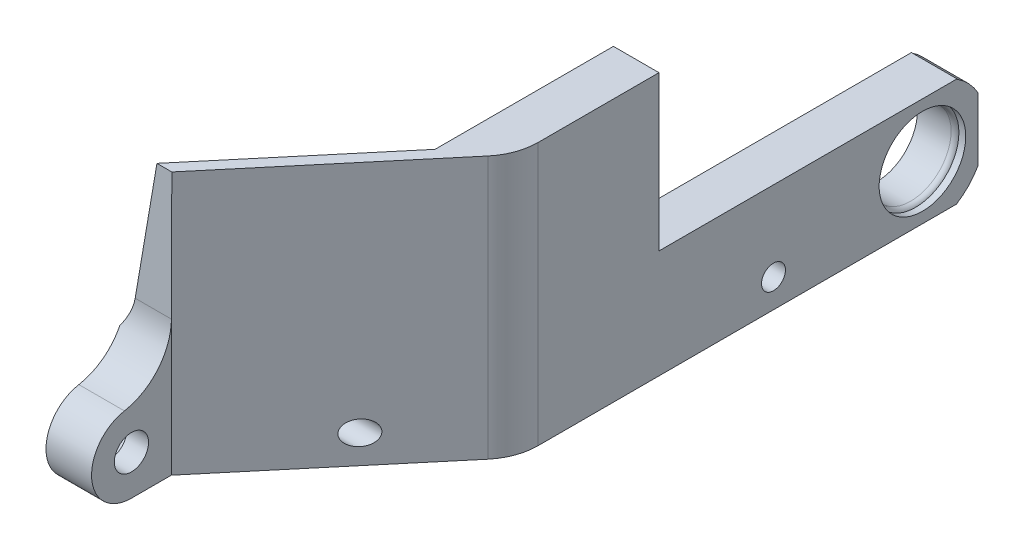
ISO-10303-21;
HEADER;
FILE_DESCRIPTION(('STEP AP214'),'2;1');
FILE_NAME('part.step','',(''),(''),'','','');
FILE_SCHEMA(('AUTOMOTIVE_DESIGN { 1 0 10303 214 1 1 1 1 }'));
ENDSEC;
DATA;
#1=APPLICATION_CONTEXT('core data for automotive mechanical design processes');
#2=APPLICATION_PROTOCOL_DEFINITION('international standard','automotive_design',2000,#1);
#3=PRODUCT_CONTEXT('',#1,'mechanical');
#4=PRODUCT('Part','Part','',(#3));
#5=PRODUCT_RELATED_PRODUCT_CATEGORY('part','',(#4));
#6=PRODUCT_DEFINITION_FORMATION('','',#4);
#7=PRODUCT_DEFINITION_CONTEXT('part definition',#1,'design');
#8=PRODUCT_DEFINITION('design','',#6,#7);
#9=PRODUCT_DEFINITION_SHAPE('','',#8);
#10=(LENGTH_UNIT() NAMED_UNIT(*) SI_UNIT(.MILLI.,.METRE.));
#11=(NAMED_UNIT(*) PLANE_ANGLE_UNIT() SI_UNIT($,.RADIAN.));
#12=(NAMED_UNIT(*) SI_UNIT($,.STERADIAN.) SOLID_ANGLE_UNIT());
#13=UNCERTAINTY_MEASURE_WITH_UNIT(LENGTH_MEASURE(1.E-05),#10,'distance_accuracy_value','');
#14=(GEOMETRIC_REPRESENTATION_CONTEXT(3) GLOBAL_UNCERTAINTY_ASSIGNED_CONTEXT((#13)) GLOBAL_UNIT_ASSIGNED_CONTEXT((#10,
#11,#12)) REPRESENTATION_CONTEXT('',''));
#15=CARTESIAN_POINT('',(0.,0.,0.));
#16=DIRECTION('',(0.,0.,1.));
#17=DIRECTION('',(1.,0.,0.));
#18=AXIS2_PLACEMENT_3D('',#15,#16,#17);
#19=CARTESIAN_POINT('',(-27.7070698214739,9.5,-15.25));
#20=DIRECTION('',(1.,0.,0.));
#21=DIRECTION('',(0.,0.,-1.));
#22=AXIS2_PLACEMENT_3D('',#19,#20,#21);
#23=CYLINDRICAL_SURFACE('',#22,7.1);
#24=CARTESIAN_POINT('',(5.93397459621556,9.5,-15.25));
#25=DIRECTION('',(1.,0.,0.));
#26=DIRECTION('',(0.,0.,-1.));
#27=AXIS2_PLACEMENT_3D('',#24,#25,#26);
#28=CIRCLE('',#27,7.1);
#29=CARTESIAN_POINT('',(5.93397459621556,9.5,-22.35));
#30=VERTEX_POINT('',#29);
#31=EDGE_CURVE('E12',#30,#30,#28,.T.);
#32=ORIENTED_EDGE('',*,*,#31,.T.);
#33=EDGE_LOOP('',(#32));
#34=FACE_BOUND('',#33,.T.);
#35=CARTESIAN_POINT('',(0.,9.5,-15.25));
#36=DIRECTION('',(1.,0.,0.));
#37=DIRECTION('',(0.,0.,-1.));
#38=AXIS2_PLACEMENT_3D('',#35,#36,#37);
#39=CIRCLE('',#38,7.1);
#40=CARTESIAN_POINT('',(0.,9.5,-22.35));
#41=VERTEX_POINT('',#40);
#42=EDGE_CURVE('E334',#41,#41,#39,.T.);
#43=ORIENTED_EDGE('',*,*,#42,.F.);
#44=EDGE_LOOP('',(#43));
#45=FACE_BOUND('',#44,.T.);
#46=ADVANCED_FACE('F129',(#34,#45),#23,.F.);
#47=CARTESIAN_POINT('',(-1.99999999999999,0.,52.240297657338));
#48=DIRECTION('',(0.,1.,0.));
#49=DIRECTION('',(0.,0.,1.));
#50=AXIS2_PLACEMENT_3D('',#47,#48,#49);
#51=PLANE('',#50);
#52=DIRECTION('',(1.,0.,0.));
#53=VECTOR('',#52,1.);
#54=CARTESIAN_POINT('',(-27.7070698214739,0.,-21.2197906160937));
#55=LINE('',#54,#53);
#56=CARTESIAN_POINT('',(0.,0.,-21.2197906160937));
#57=VERTEX_POINT('',#56);
#58=CARTESIAN_POINT('',(8.,0.,-21.2197906160937));
#59=VERTEX_POINT('',#58);
#60=EDGE_CURVE('E325',#57,#59,#55,.T.);
#61=ORIENTED_EDGE('',*,*,#60,.T.);
#62=DIRECTION('',(0.,0.,-1.));
#63=VECTOR('',#62,1.);
#64=CARTESIAN_POINT('',(8.,0.,0.));
#65=LINE('',#64,#63);
#66=CARTESIAN_POINT('',(8.00000000000001,0.,52.2402976573379));
#67=VERTEX_POINT('',#66);
#68=EDGE_CURVE('E404',#67,#59,#65,.T.);
#69=ORIENTED_EDGE('',*,*,#68,.F.);
#70=CARTESIAN_POINT('',(-1.99999999999999,0.,52.240297657338));
#71=DIRECTION('',(0.,1.,0.));
#72=DIRECTION('',(0.,0.,1.));
#73=AXIS2_PLACEMENT_3D('',#70,#71,#72);
#74=CIRCLE('',#73,10.);
#75=CARTESIAN_POINT('',(5.66044443118975,0.,58.6681737542034));
#76=VERTEX_POINT('',#75);
#77=EDGE_CURVE('E402',#76,#67,#74,.T.);
#78=ORIENTED_EDGE('',*,*,#77,.F.);
#79=DIRECTION('',(0.642787609686541,0.,-0.766044443118977));
#80=VECTOR('',#79,1.);
#81=CARTESIAN_POINT('',(5.66044443118975,0.,58.6681737542034));
#82=LINE('',#81,#80);
#83=CARTESIAN_POINT('',(-19.7070698214739,0.,88.9));
#84=VERTEX_POINT('',#83);
#85=EDGE_CURVE('E400',#84,#76,#82,.T.);
#86=ORIENTED_EDGE('',*,*,#85,.F.);
#87=DIRECTION('',(0.,0.,-1.));
#88=VECTOR('',#87,1.);
#89=CARTESIAN_POINT('',(-19.7070698214739,0.,102.9));
#90=LINE('',#89,#88);
#91=CARTESIAN_POINT('',(-19.7070698214739,0.,95.9));
#92=VERTEX_POINT('',#91);
#93=EDGE_CURVE('E387',#92,#84,#90,.T.);
#94=ORIENTED_EDGE('',*,*,#93,.F.);
#95=DIRECTION('',(1.,0.,0.));
#96=VECTOR('',#95,1.);
#97=CARTESIAN_POINT('',(-27.7070698214739,0.,95.9));
#98=LINE('',#97,#96);
#99=CARTESIAN_POINT('',(-27.7070698214739,0.,95.9));
#100=VERTEX_POINT('',#99);
#101=EDGE_CURVE('E382',#100,#92,#98,.T.);
#102=ORIENTED_EDGE('',*,*,#101,.F.);
#103=DIRECTION('',(0.,0.,1.));
#104=VECTOR('',#103,1.);
#105=CARTESIAN_POINT('',(-27.7070698214739,0.,88.9));
#106=LINE('',#105,#104);
#107=CARTESIAN_POINT('',(-27.7070698214739,0.,88.9));
#108=VERTEX_POINT('',#107);
#109=EDGE_CURVE('E391',#108,#100,#106,.T.);
#110=ORIENTED_EDGE('',*,*,#109,.F.);
#111=DIRECTION('',(-0.64278760968654,0.,0.766044443118977));
#112=VECTOR('',#111,1.);
#113=CARTESIAN_POINT('',(-2.33955556881025,0.,58.6681737542034));
#114=LINE('',#113,#112);
#115=CARTESIAN_POINT('',(-2.33955556881025,0.,58.6681737542034));
#116=VERTEX_POINT('',#115);
#117=EDGE_CURVE('E412',#116,#108,#114,.T.);
#118=ORIENTED_EDGE('',*,*,#117,.F.);
#119=CARTESIAN_POINT('',(-10.,0.,52.240297657338));
#120=DIRECTION('',(0.,-1.,0.));
#121=DIRECTION('',(0.,0.,1.));
#122=AXIS2_PLACEMENT_3D('',#119,#120,#121);
#123=CIRCLE('',#122,10.);
#124=CARTESIAN_POINT('',(0.,0.,52.2402976573379));
#125=VERTEX_POINT('',#124);
#126=EDGE_CURVE('E409',#125,#116,#123,.T.);
#127=ORIENTED_EDGE('',*,*,#126,.F.);
#128=DIRECTION('',(0.,0.,1.));
#129=VECTOR('',#128,1.);
#130=CARTESIAN_POINT('',(0.,0.,0.));
#131=LINE('',#130,#129);
#132=EDGE_CURVE('E407',#57,#125,#131,.T.);
#133=ORIENTED_EDGE('',*,*,#132,.F.);
#134=EDGE_LOOP('',(#61,#69,#78,#86,#94,#102,#110,#118,#127,#133));
#135=FACE_BOUND('',#134,.T.);
#136=ADVANCED_FACE('F505',(#135),#51,.F.);
#137=CARTESIAN_POINT('',(8.,46.1,0.));
#138=DIRECTION('',(-1.,0.,0.));
#139=DIRECTION('',(0.,0.,1.));
#140=AXIS2_PLACEMENT_3D('',#137,#138,#139);
#141=PLANE('',#140);
#142=CARTESIAN_POINT('',(8.,5.,10.9));
#143=DIRECTION('',(-1.,0.,0.));
#144=DIRECTION('',(0.,0.,1.));
#145=AXIS2_PLACEMENT_3D('',#142,#143,#144);
#146=CIRCLE('',#145,2.1);
#147=CARTESIAN_POINT('',(8.,5.,13.));
#148=VERTEX_POINT('',#147);
#149=EDGE_CURVE('E303',#148,#148,#146,.T.);
#150=ORIENTED_EDGE('',*,*,#149,.T.);
#151=EDGE_LOOP('',(#150));
#152=FACE_BOUND('',#151,.T.);
#153=CARTESIAN_POINT('',(8.,9.5,-15.25));
#154=DIRECTION('',(1.,0.,0.));
#155=DIRECTION('',(0.,0.,-1.));
#156=AXIS2_PLACEMENT_3D('',#153,#154,#155);
#157=CIRCLE('',#156,7.6);
#158=CARTESIAN_POINT('',(8.,9.5,-22.85));
#159=VERTEX_POINT('',#158);
#160=EDGE_CURVE('E306',#159,#159,#157,.T.);
#161=ORIENTED_EDGE('',*,*,#160,.F.);
#162=EDGE_LOOP('',(#161));
#163=FACE_BOUND('',#162,.T.);
#164=DIRECTION('',(0.,0.842918488759709,-0.538041282158765));
#165=VECTOR('',#164,1.);
#166=CARTESIAN_POINT('',(8.,-4.16611540040896,-6.52681460281525));
#167=LINE('',#166,#165);
#168=CARTESIAN_POINT('',(8.,18.957545443884,-21.2868231858213));
#169=VERTEX_POINT('',#168);
#170=CARTESIAN_POINT('',(8.,19.,-21.3139222518766));
#171=VERTEX_POINT('',#170);
#172=EDGE_CURVE('E310',#169,#171,#167,.T.);
#173=ORIENTED_EDGE('',*,*,#172,.T.);
#174=DIRECTION('',(0.,0.,-1.));
#175=VECTOR('',#174,1.);
#176=CARTESIAN_POINT('',(8.,19.,31.));
#177=LINE('',#176,#175);
#178=CARTESIAN_POINT('',(8.,19.,31.));
#179=VERTEX_POINT('',#178);
#180=EDGE_CURVE('E344',#179,#171,#177,.T.);
#181=ORIENTED_EDGE('',*,*,#180,.F.);
#182=DIRECTION('',(0.,-1.,0.));
#183=VECTOR('',#182,1.);
#184=CARTESIAN_POINT('',(8.,46.1,31.));
#185=LINE('',#184,#183);
#186=CARTESIAN_POINT('',(8.,46.1,31.));
#187=VERTEX_POINT('',#186);
#188=EDGE_CURVE('E341',#187,#179,#185,.T.);
#189=ORIENTED_EDGE('',*,*,#188,.F.);
#190=DIRECTION('',(0.,0.,-1.));
#191=VECTOR('',#190,1.);
#192=CARTESIAN_POINT('',(8.,46.1,0.));
#193=LINE('',#192,#191);
#194=CARTESIAN_POINT('',(8.00000000000001,46.1,52.2402976573379));
#195=VERTEX_POINT('',#194);
#196=EDGE_CURVE('E393',#195,#187,#193,.T.);
#197=ORIENTED_EDGE('',*,*,#196,.F.);
#198=DIRECTION('',(0.,-1.,0.));
#199=VECTOR('',#198,1.);
#200=CARTESIAN_POINT('',(8.00000000000001,46.1,52.2402976573379));
#201=LINE('',#200,#199);
#202=EDGE_CURVE('E423',#195,#67,#201,.T.);
#203=ORIENTED_EDGE('',*,*,#202,.T.);
#204=ORIENTED_EDGE('',*,*,#68,.T.);
#205=CARTESIAN_POINT('',(8.,9.5,-15.25));
#206=DIRECTION('',(1.,0.,0.));
#207=DIRECTION('',(0.,0.,-1.));
#208=AXIS2_PLACEMENT_3D('',#205,#206,#207);
#209=CIRCLE('',#208,11.22);
#210=CARTESIAN_POINT('',(8.,3.94789229211103,-25.));
#211=VERTEX_POINT('',#210);
#212=EDGE_CURVE('E321',#59,#211,#209,.T.);
#213=ORIENTED_EDGE('',*,*,#212,.T.);
#214=DIRECTION('',(0.,-1.,0.));
#215=VECTOR('',#214,1.);
#216=CARTESIAN_POINT('',(7.99999999999999,19.,-25.));
#217=LINE('',#216,#215);
#218=CARTESIAN_POINT('',(7.99999999999999,15.052107707889,-25.));
#219=VERTEX_POINT('',#218);
#220=EDGE_CURVE('E338',#219,#211,#217,.T.);
#221=ORIENTED_EDGE('',*,*,#220,.F.);
#222=CARTESIAN_POINT('',(8.,9.5,-15.25));
#223=DIRECTION('',(1.,0.,0.));
#224=DIRECTION('',(0.,0.,-1.));
#225=AXIS2_PLACEMENT_3D('',#222,#223,#224);
#226=CIRCLE('',#225,11.22);
#227=EDGE_CURVE('E315',#219,#169,#226,.T.);
#228=ORIENTED_EDGE('',*,*,#227,.T.);
#229=EDGE_LOOP('',(#173,#181,#189,#197,#203,#204,#213,#221,#228));
#230=FACE_BOUND('',#229,.T.);
#231=ADVANCED_FACE('F519',(#152,#163,#230),#141,.F.);
#232=CARTESIAN_POINT('',(0.,46.1,0.));
#233=DIRECTION('',(1.,0.,0.));
#234=DIRECTION('',(0.,0.,-1.));
#235=AXIS2_PLACEMENT_3D('',#232,#233,#234);
#236=PLANE('',#235);
#237=CARTESIAN_POINT('',(0.,5.,10.9));
#238=DIRECTION('',(1.,0.,0.));
#239=DIRECTION('',(0.,0.,-1.));
#240=AXIS2_PLACEMENT_3D('',#237,#238,#239);
#241=CIRCLE('',#240,4.);
#242=CARTESIAN_POINT('',(0.,5.,6.90000000000003));
#243=VERTEX_POINT('',#242);
#244=EDGE_CURVE('E299',#243,#243,#241,.T.);
#245=ORIENTED_EDGE('',*,*,#244,.T.);
#246=EDGE_LOOP('',(#245));
#247=FACE_BOUND('',#246,.T.);
#248=ORIENTED_EDGE('',*,*,#42,.T.);
#249=EDGE_LOOP('',(#248));
#250=FACE_BOUND('',#249,.T.);
#251=DIRECTION('',(0.,0.842918488759709,-0.538041282158765));
#252=VECTOR('',#251,1.);
#253=CARTESIAN_POINT('',(0.,28.5884683773361,-27.4343145418497));
#254=LINE('',#253,#252);
#255=CARTESIAN_POINT('',(0.,18.957545443884,-21.2868231858213));
#256=VERTEX_POINT('',#255);
#257=CARTESIAN_POINT('',(0.,19.,-21.3139222518766));
#258=VERTEX_POINT('',#257);
#259=EDGE_CURVE('E332',#256,#258,#254,.T.);
#260=ORIENTED_EDGE('',*,*,#259,.F.);
#261=CARTESIAN_POINT('',(0.,9.5,-15.25));
#262=DIRECTION('',(1.,0.,0.));
#263=DIRECTION('',(0.,0.,-1.));
#264=AXIS2_PLACEMENT_3D('',#261,#262,#263);
#265=CIRCLE('',#264,11.22);
#266=CARTESIAN_POINT('',(0.,15.052107707889,-25.));
#267=VERTEX_POINT('',#266);
#268=EDGE_CURVE('E330',#267,#256,#265,.T.);
#269=ORIENTED_EDGE('',*,*,#268,.F.);
#270=DIRECTION('',(0.,-1.,0.));
#271=VECTOR('',#270,1.);
#272=CARTESIAN_POINT('',(0.,19.,-25.));
#273=LINE('',#272,#271);
#274=CARTESIAN_POINT('',(0.,3.94789229211103,-25.));
#275=VERTEX_POINT('',#274);
#276=EDGE_CURVE('E335',#267,#275,#273,.T.);
#277=ORIENTED_EDGE('',*,*,#276,.T.);
#278=CARTESIAN_POINT('',(0.,9.5,-15.25));
#279=DIRECTION('',(1.,0.,0.));
#280=DIRECTION('',(0.,0.,-1.));
#281=AXIS2_PLACEMENT_3D('',#278,#279,#280);
#282=CIRCLE('',#281,11.22);
#283=EDGE_CURVE('E328',#57,#275,#282,.T.);
#284=ORIENTED_EDGE('',*,*,#283,.F.);
#285=ORIENTED_EDGE('',*,*,#132,.T.);
#286=DIRECTION('',(0.,-1.,0.));
#287=VECTOR('',#286,1.);
#288=CARTESIAN_POINT('',(0.,46.1,52.2402976573379));
#289=LINE('',#288,#287);
#290=CARTESIAN_POINT('',(0.,14.,52.240297657338));
#291=VERTEX_POINT('',#290);
#292=EDGE_CURVE('E420',#291,#125,#289,.T.);
#293=ORIENTED_EDGE('',*,*,#292,.F.);
#294=DIRECTION('',(0.,0.,1.));
#295=VECTOR('',#294,1.);
#296=CARTESIAN_POINT('',(0.,14.,-8.83195641788821));
#297=LINE('',#296,#295);
#298=CARTESIAN_POINT('',(0.,14.,55.8799999999999));
#299=VERTEX_POINT('',#298);
#300=EDGE_CURVE('E352',#291,#299,#297,.T.);
#301=ORIENTED_EDGE('',*,*,#300,.T.);
#302=DIRECTION('',(0.,0.980565510257703,0.196191947064732));
#303=VECTOR('',#302,1.);
#304=CARTESIAN_POINT('',(0.,-11.9103472104161,50.6958471666019));
#305=LINE('',#304,#303);
#306=CARTESIAN_POINT('',(0.,46.1,62.3025810870328));
#307=VERTEX_POINT('',#306);
#308=EDGE_CURVE('E355',#299,#307,#305,.T.);
#309=ORIENTED_EDGE('',*,*,#308,.T.);
#310=DIRECTION('',(0.,0.,1.));
#311=VECTOR('',#310,1.);
#312=CARTESIAN_POINT('',(0.,46.1,0.));
#313=LINE('',#312,#311);
#314=CARTESIAN_POINT('',(0.,46.1,31.));
#315=VERTEX_POINT('',#314);
#316=EDGE_CURVE('E396',#315,#307,#313,.T.);
#317=ORIENTED_EDGE('',*,*,#316,.F.);
#318=DIRECTION('',(0.,-1.,0.));
#319=VECTOR('',#318,1.);
#320=CARTESIAN_POINT('',(0.,46.1,31.));
#321=LINE('',#320,#319);
#322=CARTESIAN_POINT('',(0.,19.,31.));
#323=VERTEX_POINT('',#322);
#324=EDGE_CURVE('E349',#315,#323,#321,.T.);
#325=ORIENTED_EDGE('',*,*,#324,.T.);
#326=DIRECTION('',(0.,0.,-1.));
#327=VECTOR('',#326,1.);
#328=CARTESIAN_POINT('',(0.,19.,0.));
#329=LINE('',#328,#327);
#330=EDGE_CURVE('E440',#323,#258,#329,.T.);
#331=ORIENTED_EDGE('',*,*,#330,.T.);
#332=EDGE_LOOP('',(#260,#269,#277,#284,#285,#293,#301,#309,#317,#325,#331));
#333=FACE_BOUND('',#332,.T.);
#334=ADVANCED_FACE('F492',(#247,#250,#333),#236,.F.);
#335=CARTESIAN_POINT('',(-27.707069821474,19.,31.));
#336=DIRECTION('',(0.,-1.,0.));
#337=DIRECTION('',(0.,0.,-1.));
#338=AXIS2_PLACEMENT_3D('',#335,#336,#337);
#339=PLANE('',#338);
#340=DIRECTION('',(1.,0.,0.));
#341=VECTOR('',#340,1.);
#342=CARTESIAN_POINT('',(-27.7070698214739,19.,-21.3139222518766));
#343=LINE('',#342,#341);
#344=EDGE_CURVE('E319',#258,#171,#343,.T.);
#345=ORIENTED_EDGE('',*,*,#344,.F.);
#346=ORIENTED_EDGE('',*,*,#330,.F.);
#347=DIRECTION('',(1.,0.,0.));
#348=VECTOR('',#347,1.);
#349=CARTESIAN_POINT('',(-27.707069821474,19.,31.));
#350=LINE('',#349,#348);
#351=EDGE_CURVE('E347',#323,#179,#350,.T.);
#352=ORIENTED_EDGE('',*,*,#351,.T.);
#353=ORIENTED_EDGE('',*,*,#180,.T.);
#354=EDGE_LOOP('',(#345,#346,#352,#353));
#355=FACE_BOUND('',#354,.T.);
#356=ADVANCED_FACE('F527',(#355),#339,.F.);
#357=CARTESIAN_POINT('',(7.99999999999999,19.,-25.));
#358=DIRECTION('',(0.,0.,1.));
#359=DIRECTION('',(1.,0.,0.));
#360=AXIS2_PLACEMENT_3D('',#357,#358,#359);
#361=PLANE('',#360);
#362=DIRECTION('',(1.,0.,0.));
#363=VECTOR('',#362,1.);
#364=CARTESIAN_POINT('',(-27.7070698214739,15.052107707889,-25.));
#365=LINE('',#364,#363);
#366=EDGE_CURVE('E445',#219,#267,#365,.F.);
#367=ORIENTED_EDGE('',*,*,#366,.F.);
#368=ORIENTED_EDGE('',*,*,#220,.T.);
#369=DIRECTION('',(1.,0.,0.));
#370=VECTOR('',#369,1.);
#371=CARTESIAN_POINT('',(-27.7070698214739,3.94789229211104,-25.));
#372=LINE('',#371,#370);
#373=EDGE_CURVE('E443',#275,#211,#372,.T.);
#374=ORIENTED_EDGE('',*,*,#373,.F.);
#375=ORIENTED_EDGE('',*,*,#276,.F.);
#376=EDGE_LOOP('',(#367,#368,#374,#375));
#377=FACE_BOUND('',#376,.T.);
#378=ADVANCED_FACE('F538',(#377),#361,.F.);
#379=CARTESIAN_POINT('',(-19.7070698214739,46.1,102.9));
#380=DIRECTION('',(-1.,0.,0.));
#381=DIRECTION('',(0.,0.,1.));
#382=AXIS2_PLACEMENT_3D('',#379,#380,#381);
#383=PLANE('',#382);
#384=CARTESIAN_POINT('',(-19.7070698214739,7.,95.9));
#385=DIRECTION('',(-1.,0.,0.));
#386=DIRECTION('',(0.,0.,1.));
#387=AXIS2_PLACEMENT_3D('',#384,#385,#386);
#388=CIRCLE('',#387,3.00000000000001);
#389=CARTESIAN_POINT('',(-19.7070698214739,7.,98.9));
#390=VERTEX_POINT('',#389);
#391=EDGE_CURVE('E370',#390,#390,#388,.T.);
#392=ORIENTED_EDGE('',*,*,#391,.T.);
#393=EDGE_LOOP('',(#392));
#394=FACE_BOUND('',#393,.T.);
#395=DIRECTION('',(0.,-1.,0.));
#396=VECTOR('',#395,1.);
#397=CARTESIAN_POINT('',(-19.7070698214739,46.1,88.9));
#398=LINE('',#397,#396);
#399=CARTESIAN_POINT('',(-19.7070698214739,23.1986966979761,88.9));
#400=VERTEX_POINT('',#399);
#401=EDGE_CURVE('E152',#400,#84,#398,.T.);
#402=ORIENTED_EDGE('',*,*,#401,.F.);
#403=CARTESIAN_POINT('',(-19.7070698214739,23.7357817951123,98.8855665637176));
#404=DIRECTION('',(-1.,0.,0.));
#405=DIRECTION('',(0.,0.,1.));
#406=AXIS2_PLACEMENT_3D('',#403,#404,#405);
#407=CIRCLE('',#406,10.);
#408=CARTESIAN_POINT('',(-19.7070698214739,13.8912042685756,97.1293509380014));
#409=VERTEX_POINT('',#408);
#410=EDGE_CURVE('E459',#400,#409,#407,.T.);
#411=ORIENTED_EDGE('',*,*,#410,.T.);
#412=CARTESIAN_POINT('',(-19.7070698214739,7.,95.9));
#413=DIRECTION('',(-1.,0.,0.));
#414=DIRECTION('',(0.,0.,1.));
#415=AXIS2_PLACEMENT_3D('',#412,#413,#414);
#416=CIRCLE('',#415,7.);
#417=EDGE_CURVE('E384',#92,#409,#416,.T.);
#418=ORIENTED_EDGE('',*,*,#417,.F.);
#419=ORIENTED_EDGE('',*,*,#93,.T.);
#420=EDGE_LOOP('',(#402,#411,#418,#419));
#421=FACE_BOUND('',#420,.T.);
#422=ADVANCED_FACE('F511',(#394,#421),#383,.F.);
#423=CARTESIAN_POINT('',(-27.7070698214739,46.1,88.9));
#424=DIRECTION('',(1.,0.,0.));
#425=DIRECTION('',(0.,0.,-1.));
#426=AXIS2_PLACEMENT_3D('',#423,#424,#425);
#427=PLANE('',#426);
#428=CARTESIAN_POINT('',(-27.7070698214739,7.,95.9));
#429=DIRECTION('',(-1.,0.,0.));
#430=DIRECTION('',(0.,0.,1.));
#431=AXIS2_PLACEMENT_3D('',#428,#429,#430);
#432=CIRCLE('',#431,5.);
#433=CARTESIAN_POINT('',(-27.7070698214739,7.,100.9));
#434=VERTEX_POINT('',#433);
#435=EDGE_CURVE('E375',#434,#434,#432,.T.);
#436=ORIENTED_EDGE('',*,*,#435,.F.);
#437=EDGE_LOOP('',(#436));
#438=FACE_BOUND('',#437,.T.);
#439=CARTESIAN_POINT('',(-27.7070698214739,7.,95.9));
#440=DIRECTION('',(1.,0.,0.));
#441=DIRECTION('',(0.,0.,-1.));
#442=AXIS2_PLACEMENT_3D('',#439,#440,#441);
#443=CIRCLE('',#442,7.);
#444=CARTESIAN_POINT('',(-27.7070698214739,13.8912042685756,97.1293509380014));
#445=VERTEX_POINT('',#444);
#446=EDGE_CURVE('E380',#445,#100,#443,.T.);
#447=ORIENTED_EDGE('',*,*,#446,.F.);
#448=CARTESIAN_POINT('',(-27.7070698214739,23.7357817951123,98.8855665637176));
#449=DIRECTION('',(1.,0.,0.));
#450=DIRECTION('',(0.,0.,-1.));
#451=AXIS2_PLACEMENT_3D('',#448,#449,#450);
#452=CIRCLE('',#451,10.);
#453=CARTESIAN_POINT('',(-27.7070698214739,19.2467367055386,89.9497692191162));
#454=VERTEX_POINT('',#453);
#455=EDGE_CURVE('E144',#445,#454,#452,.T.);
#456=ORIENTED_EDGE('',*,*,#455,.T.);
#457=DIRECTION('',(0.,0.980565510257703,0.196191947064732));
#458=VECTOR('',#457,1.);
#459=CARTESIAN_POINT('',(-27.7070698214739,-18.2627036620551,82.4448650979293));
#460=LINE('',#459,#458);
#461=CARTESIAN_POINT('',(-27.7070698214739,14.,88.9));
#462=VERTEX_POINT('',#461);
#463=EDGE_CURVE('E137',#462,#454,#460,.T.);
#464=ORIENTED_EDGE('',*,*,#463,.F.);
#465=DIRECTION('',(0.,-1.,0.));
#466=VECTOR('',#465,1.);
#467=CARTESIAN_POINT('',(-27.7070698214739,46.1,88.9));
#468=LINE('',#467,#466);
#469=EDGE_CURVE('E398',#462,#108,#468,.T.);
#470=ORIENTED_EDGE('',*,*,#469,.T.);
#471=ORIENTED_EDGE('',*,*,#109,.T.);
#472=EDGE_LOOP('',(#447,#456,#464,#470,#471));
#473=FACE_BOUND('',#472,.T.);
#474=ADVANCED_FACE('F502',(#438,#473),#427,.F.);
#475=CARTESIAN_POINT('',(5.66044443118975,46.1,58.6681737542034));
#476=DIRECTION('',(-0.766044443118977,0.,-0.642787609686541));
#477=DIRECTION('',(-0.642787609686541,0.,0.766044443118977));
#478=AXIS2_PLACEMENT_3D('',#475,#476,#477);
#479=PLANE('',#478);
#480=CARTESIAN_POINT('',(-4.6032764602828,5.,70.9));
#481=DIRECTION('',(-0.766044443118977,0.,-0.642787609686541));
#482=DIRECTION('',(0.642787609686541,0.,-0.766044443118977));
#483=AXIS2_PLACEMENT_3D('',#480,#481,#482);
#484=ELLIPSE('',#483,2.7413553075978,2.1);
#485=CARTESIAN_POINT('',(-2.84116723481051,5.,68.8));
#486=VERTEX_POINT('',#485);
#487=EDGE_CURVE('E300',#486,#486,#484,.T.);
#488=ORIENTED_EDGE('',*,*,#487,.T.);
#489=EDGE_LOOP('',(#488));
#490=FACE_BOUND('',#489,.T.);
#491=DIRECTION('',(0.642787609686541,0.,-0.766044443118977));
#492=VECTOR('',#491,1.);
#493=CARTESIAN_POINT('',(5.66044443118975,46.1,58.6681737542034));
#494=LINE('',#493,#492);
#495=CARTESIAN_POINT('',(-19.6671077024529,46.1,88.8523750010891));
#496=VERTEX_POINT('',#495);
#497=CARTESIAN_POINT('',(5.66044443118975,46.1,58.6681737542034));
#498=VERTEX_POINT('',#497);
#499=EDGE_CURVE('E388',#496,#498,#494,.T.);
#500=ORIENTED_EDGE('',*,*,#499,.F.);
#501=DIRECTION('',(-0.00124492349132005,-0.999998124484135,0.00148364204328559));
#502=VECTOR('',#501,1.);
#503=CARTESIAN_POINT('',(-19.6670126980904,46.1763132715147,88.8522617792987));
#504=LINE('',#503,#502);
#505=CARTESIAN_POINT('',(-19.6949679655362,23.7209453631824,88.8855775697092));
#506=VERTEX_POINT('',#505);
#507=EDGE_CURVE('E374',#496,#506,#504,.T.);
#508=ORIENTED_EDGE('',*,*,#507,.T.);
#509=CARTESIAN_POINT('',(-28.0859550421855,23.7357817951123,98.8855665637176));
#510=DIRECTION('',(-0.766044443118977,0.,-0.642787609686541));
#511=DIRECTION('',(0.642787609686541,0.,-0.766044443118977));
#512=AXIS2_PLACEMENT_3D('',#509,#510,#511);
#513=ELLIPSE('',#512,13.0540728933228,10.);
#514=EDGE_CURVE('E457',#506,#400,#513,.T.);
#515=ORIENTED_EDGE('',*,*,#514,.T.);
#516=ORIENTED_EDGE('',*,*,#401,.T.);
#517=ORIENTED_EDGE('',*,*,#85,.T.);
#518=DIRECTION('',(0.,-1.,0.));
#519=VECTOR('',#518,1.);
#520=CARTESIAN_POINT('',(5.66044443118975,46.1,58.6681737542034));
#521=LINE('',#520,#519);
#522=EDGE_CURVE('E426',#498,#76,#521,.T.);
#523=ORIENTED_EDGE('',*,*,#522,.F.);
#524=EDGE_LOOP('',(#500,#508,#515,#516,#517,#523));
#525=FACE_BOUND('',#524,.T.);
#526=ADVANCED_FACE('F480',(#490,#525),#479,.F.);
#527=CARTESIAN_POINT('',(-1.99999999999999,46.1,52.240297657338));
#528=DIRECTION('',(0.,-1.,0.));
#529=DIRECTION('',(0.,0.,-1.));
#530=AXIS2_PLACEMENT_3D('',#527,#528,#529);
#531=CYLINDRICAL_SURFACE('',#530,10.);
#532=ORIENTED_EDGE('',*,*,#77,.T.);
#533=ORIENTED_EDGE('',*,*,#202,.F.);
#534=CARTESIAN_POINT('',(-1.99999999999999,46.1,52.240297657338));
#535=DIRECTION('',(0.,1.,0.));
#536=DIRECTION('',(0.,0.,1.));
#537=AXIS2_PLACEMENT_3D('',#534,#535,#536);
#538=CIRCLE('',#537,10.);
#539=EDGE_CURVE('E390',#498,#195,#538,.T.);
#540=ORIENTED_EDGE('',*,*,#539,.F.);
#541=ORIENTED_EDGE('',*,*,#522,.T.);
#542=EDGE_LOOP('',(#532,#533,#540,#541));
#543=FACE_BOUND('',#542,.T.);
#544=ADVANCED_FACE('F515',(#543),#531,.T.);
#545=CARTESIAN_POINT('',(-10.,46.1,52.240297657338));
#546=DIRECTION('',(0.,-1.,0.));
#547=DIRECTION('',(0.,0.,-1.));
#548=AXIS2_PLACEMENT_3D('',#545,#546,#547);
#549=CYLINDRICAL_SURFACE('',#548,10.);
#550=DIRECTION('',(0.,-1.,0.));
#551=VECTOR('',#550,1.);
#552=CARTESIAN_POINT('',(-2.33955556881025,46.1,58.6681737542034));
#553=LINE('',#552,#551);
#554=CARTESIAN_POINT('',(-2.33955556881034,14.,58.6681737542034));
#555=VERTEX_POINT('',#554);
#556=EDGE_CURVE('E418',#555,#116,#553,.T.);
#557=ORIENTED_EDGE('',*,*,#556,.F.);
#558=CARTESIAN_POINT('',(-10.,14.,52.240297657338));
#559=DIRECTION('',(0.,-1.,0.));
#560=DIRECTION('',(0.,0.,-1.));
#561=AXIS2_PLACEMENT_3D('',#558,#559,#560);
#562=CIRCLE('',#561,10.);
#563=EDGE_CURVE('E362',#555,#291,#562,.F.);
#564=ORIENTED_EDGE('',*,*,#563,.T.);
#565=ORIENTED_EDGE('',*,*,#292,.T.);
#566=ORIENTED_EDGE('',*,*,#126,.T.);
#567=EDGE_LOOP('',(#557,#564,#565,#566));
#568=FACE_BOUND('',#567,.T.);
#569=ADVANCED_FACE('F498',(#568),#549,.F.);
#570=CARTESIAN_POINT('',(-2.33955556881025,46.1,58.6681737542034));
#571=DIRECTION('',(0.766044443118977,0.,0.64278760968654));
#572=DIRECTION('',(0.642787609686541,0.,-0.766044443118977));
#573=AXIS2_PLACEMENT_3D('',#570,#571,#572);
#574=PLANE('',#573);
#575=CARTESIAN_POINT('',(-12.6032764602828,5.,70.9));
#576=DIRECTION('',(0.766044443118977,0.,0.64278760968654));
#577=DIRECTION('',(-0.642787609686541,0.,0.766044443118977));
#578=AXIS2_PLACEMENT_3D('',#575,#576,#577);
#579=ELLIPSE('',#578,5.22162915732913,4.00000000000001);
#580=CARTESIAN_POINT('',(-11.8,1.11624380981036,69.9426923926116));
#581=VERTEX_POINT('',#580);
#582=CARTESIAN_POINT('',(-11.8,8.88375619018964,69.9426923926116));
#583=VERTEX_POINT('',#582);
#584=EDGE_CURVE('E270',#581,#583,#579,.F.);
#585=ORIENTED_EDGE('',*,*,#584,.F.);
#586=DIRECTION('',(0.,1.,0.));
#587=VECTOR('',#586,1.);
#588=CARTESIAN_POINT('',(-11.8,46.1,69.9426923926116));
#589=LINE('',#588,#587);
#590=CARTESIAN_POINT('',(-11.8,3.13089268771525,69.9426923926116));
#591=VERTEX_POINT('',#590);
#592=EDGE_CURVE('E284',#581,#591,#589,.T.);
#593=ORIENTED_EDGE('',*,*,#592,.T.);
#594=CARTESIAN_POINT('',(-12.6032764602828,5.,70.9));
#595=DIRECTION('',(0.766044443118977,0.,0.64278760968654));
#596=DIRECTION('',(0.642787609686541,0.,-0.766044443118977));
#597=AXIS2_PLACEMENT_3D('',#594,#595,#596);
#598=ELLIPSE('',#597,2.7413553075978,2.1);
#599=CARTESIAN_POINT('',(-11.8,6.86910731228475,69.9426923926116));
#600=VERTEX_POINT('',#599);
#601=EDGE_CURVE('E290',#591,#600,#598,.T.);
#602=ORIENTED_EDGE('',*,*,#601,.T.);
#603=EDGE_CURVE('E282',#600,#583,#589,.T.);
#604=ORIENTED_EDGE('',*,*,#603,.T.);
#605=EDGE_LOOP('',(#585,#593,#602,#604));
#606=FACE_BOUND('',#605,.T.);
#607=ORIENTED_EDGE('',*,*,#469,.F.);
#608=DIRECTION('',(-0.64278760968654,0.,0.766044443118977));
#609=VECTOR('',#608,1.);
#610=CARTESIAN_POINT('',(34.9264199919849,14.,14.2563134980978));
#611=LINE('',#610,#609);
#612=EDGE_CURVE('E354',#555,#462,#611,.T.);
#613=ORIENTED_EDGE('',*,*,#612,.F.);
#614=ORIENTED_EDGE('',*,*,#556,.T.);
#615=ORIENTED_EDGE('',*,*,#117,.T.);
#616=EDGE_LOOP('',(#607,#613,#614,#615));
#617=FACE_BOUND('',#616,.T.);
#618=ADVANCED_FACE('F287',(#606,#617),#574,.F.);
#619=CARTESIAN_POINT('',(-1.99999999999999,46.1,52.240297657338));
#620=DIRECTION('',(0.,1.,0.));
#621=DIRECTION('',(0.,0.,1.));
#622=AXIS2_PLACEMENT_3D('',#619,#620,#621);
#623=PLANE('',#622);
#624=DIRECTION('',(1.,0.,0.));
#625=VECTOR('',#624,1.);
#626=CARTESIAN_POINT('',(-2.,46.1,31.));
#627=LINE('',#626,#625);
#628=EDGE_CURVE('E438',#315,#187,#627,.T.);
#629=ORIENTED_EDGE('',*,*,#628,.F.);
#630=ORIENTED_EDGE('',*,*,#316,.T.);
#631=DIRECTION('',(-0.64278760968654,0.,0.766044443118977));
#632=VECTOR('',#631,1.);
#633=CARTESIAN_POINT('',(38.0889238164147,46.1,16.9099692907736));
#634=LINE('',#633,#632);
#635=CARTESIAN_POINT('',(-22.2779222811175,46.1,88.8523750010891));
#636=VERTEX_POINT('',#635);
#637=EDGE_CURVE('E358',#307,#636,#634,.T.);
#638=ORIENTED_EDGE('',*,*,#637,.T.);
#639=DIRECTION('',(-1.,0.,0.));
#640=VECTOR('',#639,1.);
#641=CARTESIAN_POINT('',(-2.00000000000002,46.1,88.8523750010891));
#642=LINE('',#641,#640);
#643=EDGE_CURVE('E430',#496,#636,#642,.T.);
#644=ORIENTED_EDGE('',*,*,#643,.F.);
#645=ORIENTED_EDGE('',*,*,#499,.T.);
#646=ORIENTED_EDGE('',*,*,#539,.T.);
#647=ORIENTED_EDGE('',*,*,#196,.T.);
#648=EDGE_LOOP('',(#629,#630,#638,#644,#645,#646,#647));
#649=FACE_BOUND('',#648,.T.);
#650=ADVANCED_FACE('F485',(#649),#623,.T.);
#651=CARTESIAN_POINT('',(-27.7070698214739,7.,95.9));
#652=DIRECTION('',(1.,0.,0.));
#653=DIRECTION('',(0.,0.,-1.));
#654=AXIS2_PLACEMENT_3D('',#651,#652,#653);
#655=CYLINDRICAL_SURFACE('',#654,7.);
#656=ORIENTED_EDGE('',*,*,#417,.T.);
#657=DIRECTION('',(1.,0.,0.));
#658=VECTOR('',#657,1.);
#659=CARTESIAN_POINT('',(-27.7070698214739,13.8912042685756,97.1293509380014));
#660=LINE('',#659,#658);
#661=EDGE_CURVE('E455',#409,#445,#660,.F.);
#662=ORIENTED_EDGE('',*,*,#661,.T.);
#663=ORIENTED_EDGE('',*,*,#446,.T.);
#664=ORIENTED_EDGE('',*,*,#101,.T.);
#665=EDGE_LOOP('',(#656,#662,#663,#664));
#666=FACE_BOUND('',#665,.T.);
#667=ADVANCED_FACE('F510',(#666),#655,.T.);
#668=CARTESIAN_POINT('',(-27.7070698214739,0.131926551451763,88.920575295417));
#669=DIRECTION('',(0.,-0.00148364319298674,-0.999998899400832));
#670=DIRECTION('',(0.,0.999998899400832,-0.00148364319298674));
#671=AXIS2_PLACEMENT_3D('',#668,#669,#670);
#672=PLANE('',#671);
#673=DIRECTION('',(-0.166763758513233,-0.985995795561543,0.00146286756042911));
#674=VECTOR('',#673,1.);
#675=CARTESIAN_POINT('',(-29.9873794802085,0.517599770263186,88.9200030933414));
#676=LINE('',#675,#674);
#677=CARTESIAN_POINT('',(-26.0629437589051,23.7209453631824,88.8855775697092));
#678=VERTEX_POINT('',#677);
#679=EDGE_CURVE('E433',#636,#678,#676,.T.);
#680=ORIENTED_EDGE('',*,*,#679,.T.);
#681=DIRECTION('',(1.,0.,0.));
#682=VECTOR('',#681,1.);
#683=CARTESIAN_POINT('',(-27.7070698214739,23.7209453631824,88.8855775697092));
#684=LINE('',#683,#682);
#685=EDGE_CURVE('E277',#678,#506,#684,.T.);
#686=ORIENTED_EDGE('',*,*,#685,.T.);
#687=ORIENTED_EDGE('',*,*,#507,.F.);
#688=ORIENTED_EDGE('',*,*,#643,.T.);
#689=EDGE_LOOP('',(#680,#686,#687,#688));
#690=FACE_BOUND('',#689,.T.);
#691=ADVANCED_FACE('F476',(#690),#672,.F.);
#692=CARTESIAN_POINT('',(-23.5070698214739,7.,95.9));
#693=DIRECTION('',(-1.,0.,0.));
#694=DIRECTION('',(0.,0.,1.));
#695=AXIS2_PLACEMENT_3D('',#692,#693,#694);
#696=CYLINDRICAL_SURFACE('',#695,5.);
#697=CARTESIAN_POINT('',(-23.5070698214739,7.,95.9));
#698=DIRECTION('',(-1.,0.,0.));
#699=DIRECTION('',(0.,0.,1.));
#700=AXIS2_PLACEMENT_3D('',#697,#698,#699);
#701=CIRCLE('',#700,5.);
#702=CARTESIAN_POINT('',(-23.5070698214739,7.,100.9));
#703=VERTEX_POINT('',#702);
#704=EDGE_CURVE('E371',#703,#703,#701,.T.);
#705=ORIENTED_EDGE('',*,*,#704,.F.);
#706=EDGE_LOOP('',(#705));
#707=FACE_BOUND('',#706,.T.);
#708=ORIENTED_EDGE('',*,*,#435,.T.);
#709=EDGE_LOOP('',(#708));
#710=FACE_BOUND('',#709,.T.);
#711=ADVANCED_FACE('F766',(#707,#710),#696,.F.);
#712=CARTESIAN_POINT('',(-23.5070698214739,7.,95.9));
#713=DIRECTION('',(-1.,0.,0.));
#714=DIRECTION('',(0.,0.,1.));
#715=AXIS2_PLACEMENT_3D('',#712,#713,#714);
#716=PLANE('',#715);
#717=CARTESIAN_POINT('',(-23.5070698214739,7.,95.9));
#718=DIRECTION('',(-1.,0.,0.));
#719=DIRECTION('',(0.,0.,1.));
#720=AXIS2_PLACEMENT_3D('',#717,#718,#719);
#721=CIRCLE('',#720,3.00000000000001);
#722=CARTESIAN_POINT('',(-23.5070698214739,7.,98.9));
#723=VERTEX_POINT('',#722);
#724=EDGE_CURVE('E367',#723,#723,#721,.T.);
#725=ORIENTED_EDGE('',*,*,#724,.F.);
#726=EDGE_LOOP('',(#725));
#727=FACE_BOUND('',#726,.T.);
#728=ORIENTED_EDGE('',*,*,#704,.T.);
#729=EDGE_LOOP('',(#728));
#730=FACE_BOUND('',#729,.T.);
#731=ADVANCED_FACE('F757',(#727,#730),#716,.T.);
#732=CARTESIAN_POINT('',(8.00000000000001,7.,95.9));
#733=DIRECTION('',(-1.,0.,0.));
#734=DIRECTION('',(0.,0.,1.));
#735=AXIS2_PLACEMENT_3D('',#732,#733,#734);
#736=CYLINDRICAL_SURFACE('',#735,3.00000000000001);
#737=ORIENTED_EDGE('',*,*,#724,.T.);
#738=EDGE_LOOP('',(#737));
#739=FACE_BOUND('',#738,.T.);
#740=ORIENTED_EDGE('',*,*,#391,.F.);
#741=EDGE_LOOP('',(#740));
#742=FACE_BOUND('',#741,.T.);
#743=ADVANCED_FACE('F749',(#739,#742),#736,.F.);
#744=CARTESIAN_POINT('',(7.41089137282382,14.,-8.83195641788821));
#745=DIRECTION('',(0.,-1.,0.));
#746=DIRECTION('',(0.,0.,-1.));
#747=AXIS2_PLACEMENT_3D('',#744,#745,#746);
#748=PLANE('',#747);
#749=EDGE_CURVE('E359',#299,#555,#611,.T.);
#750=ORIENTED_EDGE('',*,*,#749,.F.);
#751=ORIENTED_EDGE('',*,*,#300,.F.);
#752=ORIENTED_EDGE('',*,*,#563,.F.);
#753=EDGE_LOOP('',(#750,#751,#752));
#754=FACE_BOUND('',#753,.T.);
#755=ADVANCED_FACE('F495',(#754),#748,.F.);
#756=CARTESIAN_POINT('',(33.1218668638215,-4.31654873160123,12.7421136338161));
#757=DIRECTION('',(0.759786653192954,-0.127558602950554,0.63753670046763));
#758=DIRECTION('',(0.64278760968654,0.,-0.766044443118977));
#759=AXIS2_PLACEMENT_3D('',#756,#757,#758);
#760=PLANE('',#759);
#761=ORIENTED_EDGE('',*,*,#637,.F.);
#762=ORIENTED_EDGE('',*,*,#308,.F.);
#763=ORIENTED_EDGE('',*,*,#749,.T.);
#764=ORIENTED_EDGE('',*,*,#612,.T.);
#765=ORIENTED_EDGE('',*,*,#463,.T.);
#766=CARTESIAN_POINT('',(-34.4514399856272,23.7357817951123,98.8855665637176));
#767=DIRECTION('',(0.759786653192954,-0.127558602950554,0.63753670046763));
#768=DIRECTION('',(0.65017247067978,0.149064022843723,-0.745020587275142));
#769=AXIS2_PLACEMENT_3D('',#766,#767,#768);
#770=ELLIPSE('',#769,13.1615894514278,10.);
#771=EDGE_CURVE('E462',#454,#678,#770,.T.);
#772=ORIENTED_EDGE('',*,*,#771,.T.);
#773=ORIENTED_EDGE('',*,*,#679,.F.);
#774=EDGE_LOOP('',(#761,#762,#763,#764,#765,#772,#773));
#775=FACE_BOUND('',#774,.T.);
#776=ADVANCED_FACE('F467',(#775),#760,.F.);
#777=CARTESIAN_POINT('',(-27.707069821474,46.1,31.));
#778=DIRECTION('',(0.,0.,1.));
#779=DIRECTION('',(1.,0.,0.));
#780=AXIS2_PLACEMENT_3D('',#777,#778,#779);
#781=PLANE('',#780);
#782=ORIENTED_EDGE('',*,*,#628,.T.);
#783=ORIENTED_EDGE('',*,*,#188,.T.);
#784=ORIENTED_EDGE('',*,*,#351,.F.);
#785=ORIENTED_EDGE('',*,*,#324,.F.);
#786=EDGE_LOOP('',(#782,#783,#784,#785));
#787=FACE_BOUND('',#786,.T.);
#788=ADVANCED_FACE('F522',(#787),#781,.F.);
#789=CARTESIAN_POINT('',(-27.7070698214739,9.5,-15.25));
#790=DIRECTION('',(1.,0.,0.));
#791=DIRECTION('',(0.,0.,-1.));
#792=AXIS2_PLACEMENT_3D('',#789,#790,#791);
#793=CYLINDRICAL_SURFACE('',#792,11.22);
#794=ORIENTED_EDGE('',*,*,#283,.T.);
#795=ORIENTED_EDGE('',*,*,#373,.T.);
#796=ORIENTED_EDGE('',*,*,#212,.F.);
#797=ORIENTED_EDGE('',*,*,#60,.F.);
#798=EDGE_LOOP('',(#794,#795,#796,#797));
#799=FACE_BOUND('',#798,.T.);
#800=ADVANCED_FACE('F543',(#799),#793,.T.);
#801=CARTESIAN_POINT('',(-27.7070698214739,-4.16611540040896,-6.52681460281525));
#802=DIRECTION('',(0.,-0.538041282158765,-0.842918488759709));
#803=DIRECTION('',(0.,0.842918488759709,-0.538041282158765));
#804=AXIS2_PLACEMENT_3D('',#801,#802,#803);
#805=PLANE('',#804);
#806=ORIENTED_EDGE('',*,*,#259,.T.);
#807=ORIENTED_EDGE('',*,*,#344,.T.);
#808=ORIENTED_EDGE('',*,*,#172,.F.);
#809=DIRECTION('',(1.,0.,0.));
#810=VECTOR('',#809,1.);
#811=CARTESIAN_POINT('',(-27.7070698214739,18.957545443884,-21.2868231858213));
#812=LINE('',#811,#810);
#813=EDGE_CURVE('E318',#256,#169,#812,.T.);
#814=ORIENTED_EDGE('',*,*,#813,.F.);
#815=EDGE_LOOP('',(#806,#807,#808,#814));
#816=FACE_BOUND('',#815,.T.);
#817=ADVANCED_FACE('F530',(#816),#805,.T.);
#818=CARTESIAN_POINT('',(-27.7070698214739,9.5,-15.25));
#819=DIRECTION('',(1.,0.,0.));
#820=DIRECTION('',(0.,0.,-1.));
#821=AXIS2_PLACEMENT_3D('',#818,#819,#820);
#822=CYLINDRICAL_SURFACE('',#821,11.22);
#823=ORIENTED_EDGE('',*,*,#268,.T.);
#824=ORIENTED_EDGE('',*,*,#813,.T.);
#825=ORIENTED_EDGE('',*,*,#227,.F.);
#826=ORIENTED_EDGE('',*,*,#366,.T.);
#827=EDGE_LOOP('',(#823,#824,#825,#826));
#828=FACE_BOUND('',#827,.T.);
#829=ADVANCED_FACE('F535',(#828),#822,.T.);
#830=CARTESIAN_POINT('',(6.8,9.5,-15.25));
#831=DIRECTION('',(1.,0.,0.));
#832=DIRECTION('',(0.,0.,-1.));
#833=AXIS2_PLACEMENT_3D('',#830,#831,#832);
#834=CYLINDRICAL_SURFACE('',#833,7.6);
#835=CARTESIAN_POINT('',(6.8,9.5,-15.25));
#836=DIRECTION('',(1.,0.,0.));
#837=DIRECTION('',(0.,0.,-1.));
#838=AXIS2_PLACEMENT_3D('',#835,#836,#837);
#839=CIRCLE('',#838,7.6);
#840=CARTESIAN_POINT('',(6.8,9.5,-22.85));
#841=VERTEX_POINT('',#840);
#842=EDGE_CURVE('E307',#841,#841,#839,.T.);
#843=ORIENTED_EDGE('',*,*,#842,.F.);
#844=EDGE_LOOP('',(#843));
#845=FACE_BOUND('',#844,.T.);
#846=ORIENTED_EDGE('',*,*,#160,.T.);
#847=EDGE_LOOP('',(#846));
#848=FACE_BOUND('',#847,.T.);
#849=ADVANCED_FACE('F566',(#845,#848),#834,.F.);
#850=CARTESIAN_POINT('',(-27.7070698214739,5.,70.9));
#851=DIRECTION('',(1.,0.,0.));
#852=DIRECTION('',(0.,0.,-1.));
#853=AXIS2_PLACEMENT_3D('',#850,#851,#852);
#854=CYLINDRICAL_SURFACE('',#853,2.1);
#855=ORIENTED_EDGE('',*,*,#601,.F.);
#856=CARTESIAN_POINT('',(-11.8,5.,70.9));
#857=DIRECTION('',(1.,0.,0.));
#858=DIRECTION('',(0.,0.,-1.));
#859=AXIS2_PLACEMENT_3D('',#856,#857,#858);
#860=CIRCLE('',#859,2.1);
#861=EDGE_CURVE('E278',#591,#600,#860,.F.);
#862=ORIENTED_EDGE('',*,*,#861,.T.);
#863=EDGE_LOOP('',(#855,#862));
#864=FACE_BOUND('',#863,.T.);
#865=ORIENTED_EDGE('',*,*,#487,.F.);
#866=EDGE_LOOP('',(#865));
#867=FACE_BOUND('',#866,.T.);
#868=ADVANCED_FACE('F572',(#864,#867),#854,.F.);
#869=CARTESIAN_POINT('',(-27.7070698214739,5.,10.9));
#870=DIRECTION('',(1.,0.,0.));
#871=DIRECTION('',(0.,0.,-1.));
#872=AXIS2_PLACEMENT_3D('',#869,#870,#871);
#873=CYLINDRICAL_SURFACE('',#872,2.1);
#874=CARTESIAN_POINT('',(4.2,5.,10.9));
#875=DIRECTION('',(1.,0.,0.));
#876=DIRECTION('',(0.,0.,-1.));
#877=AXIS2_PLACEMENT_3D('',#874,#875,#876);
#878=CIRCLE('',#877,2.1);
#879=CARTESIAN_POINT('',(4.2,5.,8.80000000000003));
#880=VERTEX_POINT('',#879);
#881=EDGE_CURVE('E292',#880,#880,#878,.T.);
#882=ORIENTED_EDGE('',*,*,#881,.F.);
#883=EDGE_LOOP('',(#882));
#884=FACE_BOUND('',#883,.T.);
#885=ORIENTED_EDGE('',*,*,#149,.F.);
#886=EDGE_LOOP('',(#885));
#887=FACE_BOUND('',#886,.T.);
#888=ADVANCED_FACE('F578',(#884,#887),#873,.F.);
#889=CARTESIAN_POINT('',(-27.7070698214739,5.,10.9));
#890=DIRECTION('',(1.,0.,0.));
#891=DIRECTION('',(0.,0.,-1.));
#892=AXIS2_PLACEMENT_3D('',#889,#890,#891);
#893=CYLINDRICAL_SURFACE('',#892,4.);
#894=CARTESIAN_POINT('',(4.2,5.,10.9));
#895=DIRECTION('',(1.,0.,0.));
#896=DIRECTION('',(0.,0.,-1.));
#897=AXIS2_PLACEMENT_3D('',#894,#895,#896);
#898=CIRCLE('',#897,4.);
#899=CARTESIAN_POINT('',(4.2,5.,6.90000000000003));
#900=VERTEX_POINT('',#899);
#901=EDGE_CURVE('E296',#900,#900,#898,.T.);
#902=ORIENTED_EDGE('',*,*,#901,.T.);
#903=EDGE_LOOP('',(#902));
#904=FACE_BOUND('',#903,.T.);
#905=ORIENTED_EDGE('',*,*,#244,.F.);
#906=EDGE_LOOP('',(#905));
#907=FACE_BOUND('',#906,.T.);
#908=ADVANCED_FACE('F615',(#904,#907),#893,.F.);
#909=CARTESIAN_POINT('',(4.2,5.,10.9));
#910=DIRECTION('',(1.,0.,0.));
#911=DIRECTION('',(0.,0.,-1.));
#912=AXIS2_PLACEMENT_3D('',#909,#910,#911);
#913=PLANE('',#912);
#914=ORIENTED_EDGE('',*,*,#901,.F.);
#915=EDGE_LOOP('',(#914));
#916=FACE_BOUND('',#915,.T.);
#917=ORIENTED_EDGE('',*,*,#881,.T.);
#918=EDGE_LOOP('',(#917));
#919=FACE_BOUND('',#918,.T.);
#920=ADVANCED_FACE('F610',(#916,#919),#913,.F.);
#921=CARTESIAN_POINT('',(-11.8,5.,70.9));
#922=DIRECTION('',(-1.,0.,0.));
#923=DIRECTION('',(0.,0.,1.));
#924=AXIS2_PLACEMENT_3D('',#921,#922,#923);
#925=CYLINDRICAL_SURFACE('',#924,4.00000000000001);
#926=ORIENTED_EDGE('',*,*,#584,.T.);
#927=CARTESIAN_POINT('',(-11.8,5.,70.9));
#928=DIRECTION('',(1.,0.,0.));
#929=DIRECTION('',(0.,0.,-1.));
#930=AXIS2_PLACEMENT_3D('',#927,#928,#929);
#931=CIRCLE('',#930,4.00000000000001);
#932=EDGE_CURVE('E273',#583,#581,#931,.T.);
#933=ORIENTED_EDGE('',*,*,#932,.T.);
#934=EDGE_LOOP('',(#926,#933));
#935=FACE_BOUND('',#934,.T.);
#936=ADVANCED_FACE('F272',(#935),#925,.F.);
#937=CARTESIAN_POINT('',(-11.8,0.,0.));
#938=DIRECTION('',(1.,0.,0.));
#939=DIRECTION('',(0.,0.,-1.));
#940=AXIS2_PLACEMENT_3D('',#937,#938,#939);
#941=PLANE('',#940);
#942=ORIENTED_EDGE('',*,*,#932,.F.);
#943=ORIENTED_EDGE('',*,*,#603,.F.);
#944=ORIENTED_EDGE('',*,*,#861,.F.);
#945=ORIENTED_EDGE('',*,*,#592,.F.);
#946=EDGE_LOOP('',(#942,#943,#944,#945));
#947=FACE_BOUND('',#946,.T.);
#948=ADVANCED_FACE('F281',(#947),#941,.F.);
#949=CARTESIAN_POINT('',(-27.7070698214739,23.7357817951123,98.8855665637176));
#950=DIRECTION('',(1.,0.,0.));
#951=DIRECTION('',(0.,0.,-1.));
#952=AXIS2_PLACEMENT_3D('',#949,#950,#951);
#953=CYLINDRICAL_SURFACE('',#952,10.);
#954=ORIENTED_EDGE('',*,*,#455,.F.);
#955=ORIENTED_EDGE('',*,*,#661,.F.);
#956=ORIENTED_EDGE('',*,*,#410,.F.);
#957=ORIENTED_EDGE('',*,*,#514,.F.);
#958=ORIENTED_EDGE('',*,*,#685,.F.);
#959=ORIENTED_EDGE('',*,*,#771,.F.);
#960=EDGE_LOOP('',(#954,#955,#956,#957,#958,#959));
#961=FACE_BOUND('',#960,.T.);
#962=ADVANCED_FACE('F472',(#961),#953,.F.);
#963=CARTESIAN_POINT('',(5.93397459621556,9.5,-15.25));
#964=DIRECTION('',(1.,0.,0.));
#965=DIRECTION('',(0.,0.,-1.));
#966=AXIS2_PLACEMENT_3D('',#963,#964,#965);
#967=TOROIDAL_SURFACE('',#966,8.1,1.);
#968=ORIENTED_EDGE('',*,*,#31,.F.);
#969=EDGE_LOOP('',(#968));
#970=FACE_BOUND('',#969,.T.);
#971=ORIENTED_EDGE('',*,*,#842,.T.);
#972=EDGE_LOOP('',(#971));
#973=FACE_BOUND('',#972,.T.);
#974=ADVANCED_FACE('F131',(#970,#973),#967,.T.);
#975=CLOSED_SHELL('',(#46,#136,#231,#334,#356,#378,#422,#474,#526,#544,#569,#618,#650,#667,#691,
#711,#731,#743,#755,#776,#788,#800,#817,#829,#849,#868,#888,#908,#920,#936,#948,#962,#974));
#976=MANIFOLD_SOLID_BREP('B2',#975);
#977=ADVANCED_BREP_SHAPE_REPRESENTATION('',(#18,#976),#14);
#978=SHAPE_DEFINITION_REPRESENTATION(#9,#977);
ENDSEC;
END-ISO-10303-21;
